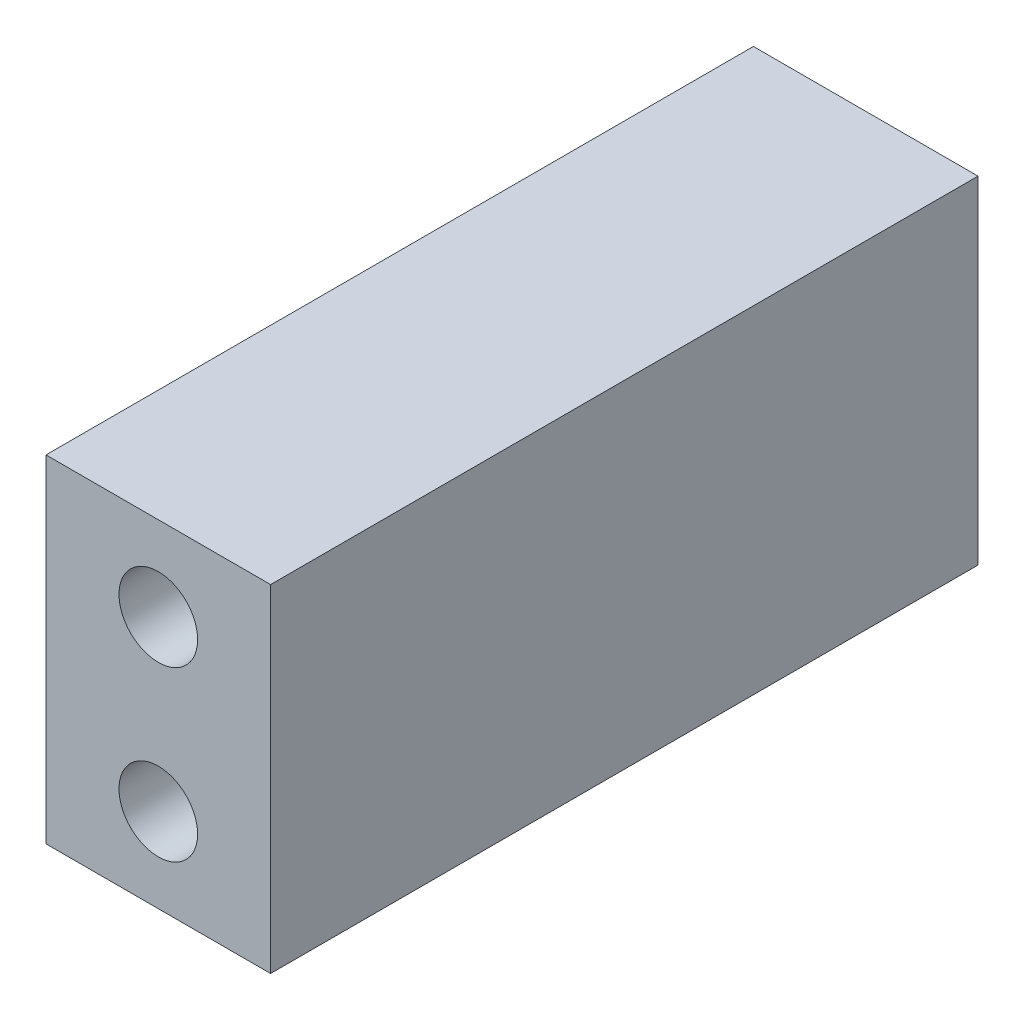
ISO-10303-21;
HEADER;
FILE_DESCRIPTION(('STEP AP214'),'2;1');
FILE_NAME('part.step','',(''),(''),'','','');
FILE_SCHEMA(('AUTOMOTIVE_DESIGN { 1 0 10303 214 1 1 1 1 }'));
ENDSEC;
DATA;
#1=APPLICATION_CONTEXT('core data for automotive mechanical design processes');
#2=APPLICATION_PROTOCOL_DEFINITION('international standard','automotive_design',2000,#1);
#3=PRODUCT_CONTEXT('',#1,'mechanical');
#4=PRODUCT('Part','Part','',(#3));
#5=PRODUCT_RELATED_PRODUCT_CATEGORY('part','',(#4));
#6=PRODUCT_DEFINITION_FORMATION('','',#4);
#7=PRODUCT_DEFINITION_CONTEXT('part definition',#1,'design');
#8=PRODUCT_DEFINITION('design','',#6,#7);
#9=PRODUCT_DEFINITION_SHAPE('','',#8);
#10=(LENGTH_UNIT() NAMED_UNIT(*) SI_UNIT(.MILLI.,.METRE.));
#11=(NAMED_UNIT(*) PLANE_ANGLE_UNIT() SI_UNIT($,.RADIAN.));
#12=(NAMED_UNIT(*) SI_UNIT($,.STERADIAN.) SOLID_ANGLE_UNIT());
#13=UNCERTAINTY_MEASURE_WITH_UNIT(LENGTH_MEASURE(1.E-05),#10,'distance_accuracy_value','');
#14=(GEOMETRIC_REPRESENTATION_CONTEXT(3) GLOBAL_UNCERTAINTY_ASSIGNED_CONTEXT((#13)) GLOBAL_UNIT_ASSIGNED_CONTEXT((#10,
#11,#12)) REPRESENTATION_CONTEXT('',''));
#15=CARTESIAN_POINT('',(0.,0.,0.));
#16=DIRECTION('',(0.,0.,1.));
#17=DIRECTION('',(1.,0.,0.));
#18=AXIS2_PLACEMENT_3D('',#15,#16,#17);
#19=CARTESIAN_POINT('',(0.,-15.,63.));
#20=DIRECTION('',(0.,1.,0.));
#21=DIRECTION('',(0.,0.,1.));
#22=AXIS2_PLACEMENT_3D('',#19,#20,#21);
#23=PLANE('',#22);
#24=DIRECTION('',(1.,0.,0.));
#25=VECTOR('',#24,1.);
#26=CARTESIAN_POINT('',(0.,-15.,0.));
#27=LINE('',#26,#25);
#28=CARTESIAN_POINT('',(-10.,-15.,0.));
#29=VERTEX_POINT('',#28);
#30=CARTESIAN_POINT('',(9.99999999999999,-15.,0.));
#31=VERTEX_POINT('',#30);
#32=EDGE_CURVE('E116',#29,#31,#27,.T.);
#33=ORIENTED_EDGE('',*,*,#32,.T.);
#34=DIRECTION('',(0.,0.,-1.));
#35=VECTOR('',#34,1.);
#36=CARTESIAN_POINT('',(9.99999999999999,-15.,63.));
#37=LINE('',#36,#35);
#38=CARTESIAN_POINT('',(9.99999999999999,-15.,63.));
#39=VERTEX_POINT('',#38);
#40=EDGE_CURVE('E11',#39,#31,#37,.T.);
#41=ORIENTED_EDGE('',*,*,#40,.F.);
#42=DIRECTION('',(1.,0.,0.));
#43=VECTOR('',#42,1.);
#44=CARTESIAN_POINT('',(0.,-15.,63.));
#45=LINE('',#44,#43);
#46=CARTESIAN_POINT('',(-10.,-15.,63.));
#47=VERTEX_POINT('',#46);
#48=EDGE_CURVE('E90',#47,#39,#45,.T.);
#49=ORIENTED_EDGE('',*,*,#48,.F.);
#50=DIRECTION('',(0.,0.,-1.));
#51=VECTOR('',#50,1.);
#52=CARTESIAN_POINT('',(-10.,-15.,63.));
#53=LINE('',#52,#51);
#54=EDGE_CURVE('E56',#47,#29,#53,.T.);
#55=ORIENTED_EDGE('',*,*,#54,.T.);
#56=EDGE_LOOP('',(#33,#41,#49,#55));
#57=FACE_BOUND('',#56,.T.);
#58=ADVANCED_FACE('F39',(#57),#23,.F.);
#59=CARTESIAN_POINT('',(9.99999999999999,0.,63.));
#60=DIRECTION('',(-1.,0.,0.));
#61=DIRECTION('',(0.,0.,1.));
#62=AXIS2_PLACEMENT_3D('',#59,#60,#61);
#63=PLANE('',#62);
#64=DIRECTION('',(0.,1.,0.));
#65=VECTOR('',#64,1.);
#66=CARTESIAN_POINT('',(9.99999999999999,0.,0.));
#67=LINE('',#66,#65);
#68=CARTESIAN_POINT('',(9.99999999999999,15.,0.));
#69=VERTEX_POINT('',#68);
#70=EDGE_CURVE('E96',#31,#69,#67,.T.);
#71=ORIENTED_EDGE('',*,*,#70,.T.);
#72=DIRECTION('',(0.,0.,-1.));
#73=VECTOR('',#72,1.);
#74=CARTESIAN_POINT('',(9.99999999999999,15.,63.));
#75=LINE('',#74,#73);
#76=CARTESIAN_POINT('',(9.99999999999999,15.,63.));
#77=VERTEX_POINT('',#76);
#78=EDGE_CURVE('E48',#77,#69,#75,.T.);
#79=ORIENTED_EDGE('',*,*,#78,.F.);
#80=DIRECTION('',(0.,1.,0.));
#81=VECTOR('',#80,1.);
#82=CARTESIAN_POINT('',(9.99999999999999,0.,63.));
#83=LINE('',#82,#81);
#84=EDGE_CURVE('E81',#39,#77,#83,.T.);
#85=ORIENTED_EDGE('',*,*,#84,.F.);
#86=ORIENTED_EDGE('',*,*,#40,.T.);
#87=EDGE_LOOP('',(#71,#79,#85,#86));
#88=FACE_BOUND('',#87,.T.);
#89=ADVANCED_FACE('F95',(#88),#63,.F.);
#90=CARTESIAN_POINT('',(0.,15.,63.));
#91=DIRECTION('',(0.,1.,0.));
#92=DIRECTION('',(0.,0.,1.));
#93=AXIS2_PLACEMENT_3D('',#90,#91,#92);
#94=PLANE('',#93);
#95=DIRECTION('',(1.,0.,0.));
#96=VECTOR('',#95,1.);
#97=CARTESIAN_POINT('',(0.,15.,0.));
#98=LINE('',#97,#96);
#99=CARTESIAN_POINT('',(-10.,15.,0.));
#100=VERTEX_POINT('',#99);
#101=EDGE_CURVE('E121',#100,#69,#98,.T.);
#102=ORIENTED_EDGE('',*,*,#101,.F.);
#103=DIRECTION('',(0.,0.,-1.));
#104=VECTOR('',#103,1.);
#105=CARTESIAN_POINT('',(-10.,15.,63.));
#106=LINE('',#105,#104);
#107=CARTESIAN_POINT('',(-10.,15.,63.));
#108=VERTEX_POINT('',#107);
#109=EDGE_CURVE('E70',#108,#100,#106,.T.);
#110=ORIENTED_EDGE('',*,*,#109,.F.);
#111=DIRECTION('',(1.,0.,0.));
#112=VECTOR('',#111,1.);
#113=CARTESIAN_POINT('',(0.,15.,63.));
#114=LINE('',#113,#112);
#115=EDGE_CURVE('E89',#108,#77,#114,.T.);
#116=ORIENTED_EDGE('',*,*,#115,.T.);
#117=ORIENTED_EDGE('',*,*,#78,.T.);
#118=EDGE_LOOP('',(#102,#110,#116,#117));
#119=FACE_BOUND('',#118,.T.);
#120=ADVANCED_FACE('F100',(#119),#94,.T.);
#121=CARTESIAN_POINT('',(0.,-7.5,63.));
#122=DIRECTION('',(0.,0.,-1.));
#123=DIRECTION('',(-1.,0.,0.));
#124=AXIS2_PLACEMENT_3D('',#121,#122,#123);
#125=CYLINDRICAL_SURFACE('',#124,3.5);
#126=CARTESIAN_POINT('',(0.,-7.5,63.));
#127=DIRECTION('',(0.,0.,1.));
#128=DIRECTION('',(1.,0.,0.));
#129=AXIS2_PLACEMENT_3D('',#126,#127,#128);
#130=CIRCLE('',#129,3.5);
#131=CARTESIAN_POINT('',(3.5,-7.5,63.));
#132=VERTEX_POINT('',#131);
#133=EDGE_CURVE('E105',#132,#132,#130,.T.);
#134=ORIENTED_EDGE('',*,*,#133,.T.);
#135=EDGE_LOOP('',(#134));
#136=FACE_BOUND('',#135,.T.);
#137=CARTESIAN_POINT('',(0.,-7.5,0.));
#138=DIRECTION('',(0.,0.,1.));
#139=DIRECTION('',(1.,0.,0.));
#140=AXIS2_PLACEMENT_3D('',#137,#138,#139);
#141=CIRCLE('',#140,3.5);
#142=CARTESIAN_POINT('',(3.5,-7.5,0.));
#143=VERTEX_POINT('',#142);
#144=EDGE_CURVE('E128',#143,#143,#141,.T.);
#145=ORIENTED_EDGE('',*,*,#144,.F.);
#146=EDGE_LOOP('',(#145));
#147=FACE_BOUND('',#146,.T.);
#148=ADVANCED_FACE('F160',(#136,#147),#125,.F.);
#149=CARTESIAN_POINT('',(-10.,0.,63.));
#150=DIRECTION('',(-1.,0.,0.));
#151=DIRECTION('',(0.,0.,1.));
#152=AXIS2_PLACEMENT_3D('',#149,#150,#151);
#153=PLANE('',#152);
#154=DIRECTION('',(0.,1.,0.));
#155=VECTOR('',#154,1.);
#156=CARTESIAN_POINT('',(-10.,0.,0.));
#157=LINE('',#156,#155);
#158=EDGE_CURVE('E124',#29,#100,#157,.T.);
#159=ORIENTED_EDGE('',*,*,#158,.F.);
#160=ORIENTED_EDGE('',*,*,#54,.F.);
#161=DIRECTION('',(0.,1.,0.));
#162=VECTOR('',#161,1.);
#163=CARTESIAN_POINT('',(-10.,0.,63.));
#164=LINE('',#163,#162);
#165=EDGE_CURVE('E102',#47,#108,#164,.T.);
#166=ORIENTED_EDGE('',*,*,#165,.T.);
#167=ORIENTED_EDGE('',*,*,#109,.T.);
#168=EDGE_LOOP('',(#159,#160,#166,#167));
#169=FACE_BOUND('',#168,.T.);
#170=ADVANCED_FACE('F158',(#169),#153,.T.);
#171=CARTESIAN_POINT('',(0.,7.5,63.));
#172=DIRECTION('',(0.,0.,-1.));
#173=DIRECTION('',(-1.,0.,0.));
#174=AXIS2_PLACEMENT_3D('',#171,#172,#173);
#175=CYLINDRICAL_SURFACE('',#174,3.5);
#176=CARTESIAN_POINT('',(0.,7.5,63.));
#177=DIRECTION('',(0.,0.,1.));
#178=DIRECTION('',(1.,0.,0.));
#179=AXIS2_PLACEMENT_3D('',#176,#177,#178);
#180=CIRCLE('',#179,3.5);
#181=CARTESIAN_POINT('',(3.5,7.5,63.));
#182=VERTEX_POINT('',#181);
#183=EDGE_CURVE('E112',#182,#182,#180,.F.);
#184=ORIENTED_EDGE('',*,*,#183,.F.);
#185=EDGE_LOOP('',(#184));
#186=FACE_BOUND('',#185,.T.);
#187=CARTESIAN_POINT('',(0.,7.5,0.));
#188=DIRECTION('',(0.,0.,1.));
#189=DIRECTION('',(1.,0.,0.));
#190=AXIS2_PLACEMENT_3D('',#187,#188,#189);
#191=CIRCLE('',#190,3.5);
#192=CARTESIAN_POINT('',(3.5,7.5,0.));
#193=VERTEX_POINT('',#192);
#194=EDGE_CURVE('E132',#193,#193,#191,.F.);
#195=ORIENTED_EDGE('',*,*,#194,.T.);
#196=EDGE_LOOP('',(#195));
#197=FACE_BOUND('',#196,.T.);
#198=ADVANCED_FACE('F142',(#186,#197),#175,.F.);
#199=CARTESIAN_POINT('',(0.,0.,63.));
#200=DIRECTION('',(0.,0.,1.));
#201=DIRECTION('',(1.,0.,0.));
#202=AXIS2_PLACEMENT_3D('',#199,#200,#201);
#203=PLANE('',#202);
#204=ORIENTED_EDGE('',*,*,#48,.T.);
#205=ORIENTED_EDGE('',*,*,#84,.T.);
#206=ORIENTED_EDGE('',*,*,#115,.F.);
#207=ORIENTED_EDGE('',*,*,#165,.F.);
#208=EDGE_LOOP('',(#204,#205,#206,#207));
#209=FACE_BOUND('',#208,.T.);
#210=ORIENTED_EDGE('',*,*,#133,.F.);
#211=EDGE_LOOP('',(#210));
#212=FACE_BOUND('',#211,.T.);
#213=ORIENTED_EDGE('',*,*,#183,.T.);
#214=EDGE_LOOP('',(#213));
#215=FACE_BOUND('',#214,.T.);
#216=ADVANCED_FACE('F85',(#209,#212,#215),#203,.T.);
#217=CARTESIAN_POINT('',(0.,0.,0.));
#218=DIRECTION('',(0.,0.,1.));
#219=DIRECTION('',(1.,0.,0.));
#220=AXIS2_PLACEMENT_3D('',#217,#218,#219);
#221=PLANE('',#220);
#222=ORIENTED_EDGE('',*,*,#32,.F.);
#223=ORIENTED_EDGE('',*,*,#158,.T.);
#224=ORIENTED_EDGE('',*,*,#101,.T.);
#225=ORIENTED_EDGE('',*,*,#70,.F.);
#226=EDGE_LOOP('',(#222,#223,#224,#225));
#227=FACE_BOUND('',#226,.T.);
#228=ORIENTED_EDGE('',*,*,#144,.T.);
#229=EDGE_LOOP('',(#228));
#230=FACE_BOUND('',#229,.T.);
#231=ORIENTED_EDGE('',*,*,#194,.F.);
#232=EDGE_LOOP('',(#231));
#233=FACE_BOUND('',#232,.T.);
#234=ADVANCED_FACE('F144',(#227,#230,#233),#221,.F.);
#235=CLOSED_SHELL('',(#58,#89,#120,#148,#170,#198,#216,#234));
#236=MANIFOLD_SOLID_BREP('B2',#235);
#237=ADVANCED_BREP_SHAPE_REPRESENTATION('',(#18,#236),#14);
#238=SHAPE_DEFINITION_REPRESENTATION(#9,#237);
ENDSEC;
END-ISO-10303-21;
